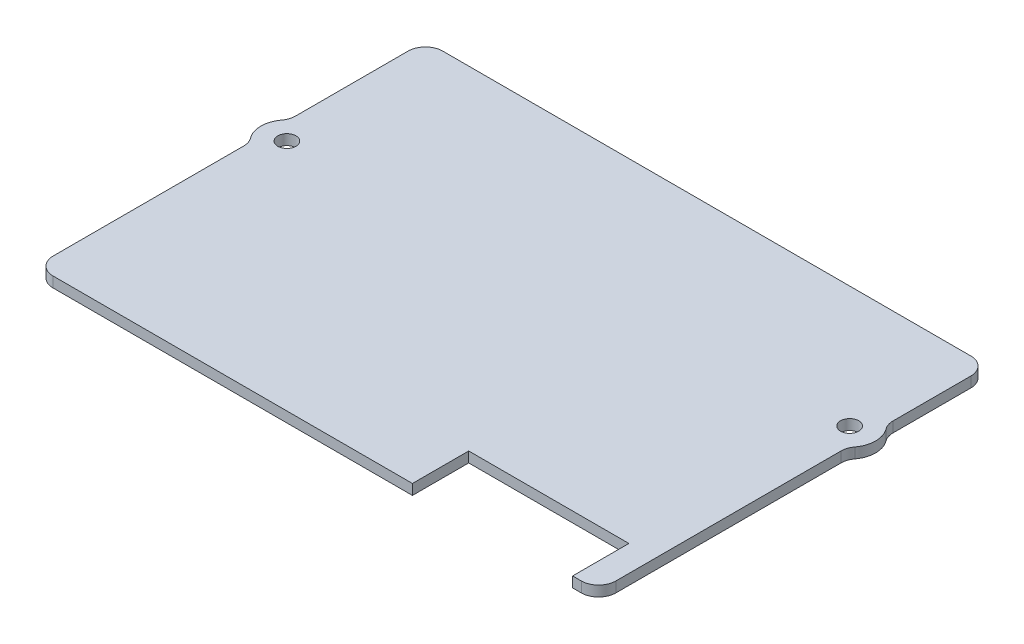
ISO-10303-21;
HEADER;
FILE_DESCRIPTION(('STEP AP214'),'2;1');
FILE_NAME('part.step','',(''),(''),'','','');
FILE_SCHEMA(('AUTOMOTIVE_DESIGN { 1 0 10303 214 1 1 1 1 }'));
ENDSEC;
DATA;
#1=APPLICATION_CONTEXT('core data for automotive mechanical design processes');
#2=APPLICATION_PROTOCOL_DEFINITION('international standard','automotive_design',2000,#1);
#3=PRODUCT_CONTEXT('',#1,'mechanical');
#4=PRODUCT('Part','Part','',(#3));
#5=PRODUCT_RELATED_PRODUCT_CATEGORY('part','',(#4));
#6=PRODUCT_DEFINITION_FORMATION('','',#4);
#7=PRODUCT_DEFINITION_CONTEXT('part definition',#1,'design');
#8=PRODUCT_DEFINITION('design','',#6,#7);
#9=PRODUCT_DEFINITION_SHAPE('','',#8);
#10=(LENGTH_UNIT() NAMED_UNIT(*) SI_UNIT(.MILLI.,.METRE.));
#11=(NAMED_UNIT(*) PLANE_ANGLE_UNIT() SI_UNIT($,.RADIAN.));
#12=(NAMED_UNIT(*) SI_UNIT($,.STERADIAN.) SOLID_ANGLE_UNIT());
#13=UNCERTAINTY_MEASURE_WITH_UNIT(LENGTH_MEASURE(1.E-05),#10,'distance_accuracy_value','');
#14=(GEOMETRIC_REPRESENTATION_CONTEXT(3) GLOBAL_UNCERTAINTY_ASSIGNED_CONTEXT((#13)) GLOBAL_UNIT_ASSIGNED_CONTEXT((#10,
#11,#12)) REPRESENTATION_CONTEXT('',''));
#15=CARTESIAN_POINT('',(0.,0.,0.));
#16=DIRECTION('',(0.,0.,1.));
#17=DIRECTION('',(1.,0.,0.));
#18=AXIS2_PLACEMENT_3D('',#15,#16,#17);
#19=CARTESIAN_POINT('',(0.,1.2,0.));
#20=DIRECTION('',(0.,0.,-1.));
#21=DIRECTION('',(-1.,0.,0.));
#22=AXIS2_PLACEMENT_3D('',#19,#20,#21);
#23=PLANE('',#22);
#24=DIRECTION('',(1.,0.,0.));
#25=VECTOR('',#24,1.);
#26=CARTESIAN_POINT('',(0.,0.,0.));
#27=LINE('',#26,#25);
#28=CARTESIAN_POINT('',(2.,0.,0.));
#29=VERTEX_POINT('',#28);
#30=CARTESIAN_POINT('',(43.5,0.,0.));
#31=VERTEX_POINT('',#30);
#32=EDGE_CURVE('E188',#29,#31,#27,.T.);
#33=ORIENTED_EDGE('',*,*,#32,.T.);
#34=DIRECTION('',(0.,1.,0.));
#35=VECTOR('',#34,1.);
#36=CARTESIAN_POINT('',(43.5,0.,0.));
#37=LINE('',#36,#35);
#38=CARTESIAN_POINT('',(43.5,1.2,0.));
#39=VERTEX_POINT('',#38);
#40=EDGE_CURVE('E171',#31,#39,#37,.T.);
#41=ORIENTED_EDGE('',*,*,#40,.T.);
#42=DIRECTION('',(1.,0.,0.));
#43=VECTOR('',#42,1.);
#44=CARTESIAN_POINT('',(0.,1.2,0.));
#45=LINE('',#44,#43);
#46=CARTESIAN_POINT('',(2.,1.2,0.));
#47=VERTEX_POINT('',#46);
#48=EDGE_CURVE('E313',#47,#39,#45,.T.);
#49=ORIENTED_EDGE('',*,*,#48,.F.);
#50=DIRECTION('',(0.,-1.,0.));
#51=VECTOR('',#50,1.);
#52=CARTESIAN_POINT('',(2.,1.2,0.));
#53=LINE('',#52,#51);
#54=EDGE_CURVE('E195',#47,#29,#53,.T.);
#55=ORIENTED_EDGE('',*,*,#54,.T.);
#56=EDGE_LOOP('',(#33,#41,#49,#55));
#57=FACE_BOUND('',#56,.T.);
#58=ADVANCED_FACE('F35',(#57),#23,.F.);
#59=CARTESIAN_POINT('',(65.,1.2,0.));
#60=DIRECTION('',(-1.,0.,0.));
#61=DIRECTION('',(0.,0.,1.));
#62=AXIS2_PLACEMENT_3D('',#59,#60,#61);
#63=PLANE('',#62);
#64=DIRECTION('',(0.,0.,-1.));
#65=VECTOR('',#64,1.);
#66=CARTESIAN_POINT('',(65.,0.,0.));
#67=LINE('',#66,#65);
#68=CARTESIAN_POINT('',(65.,0.,-2.));
#69=VERTEX_POINT('',#68);
#70=CARTESIAN_POINT('',(65.,0.,-28.));
#71=VERTEX_POINT('',#70);
#72=EDGE_CURVE('E199',#69,#71,#67,.T.);
#73=ORIENTED_EDGE('',*,*,#72,.T.);
#74=DIRECTION('',(0.,1.,0.));
#75=VECTOR('',#74,1.);
#76=CARTESIAN_POINT('',(65.,1.2,-28.));
#77=LINE('',#76,#75);
#78=CARTESIAN_POINT('',(65.,1.2,-28.));
#79=VERTEX_POINT('',#78);
#80=EDGE_CURVE('E250',#71,#79,#77,.T.);
#81=ORIENTED_EDGE('',*,*,#80,.T.);
#82=DIRECTION('',(0.,0.,-1.));
#83=VECTOR('',#82,1.);
#84=CARTESIAN_POINT('',(65.,1.2,0.));
#85=LINE('',#84,#83);
#86=CARTESIAN_POINT('',(65.,1.2,-2.));
#87=VERTEX_POINT('',#86);
#88=EDGE_CURVE('E316',#87,#79,#85,.T.);
#89=ORIENTED_EDGE('',*,*,#88,.F.);
#90=DIRECTION('',(0.,-1.,0.));
#91=VECTOR('',#90,1.);
#92=CARTESIAN_POINT('',(65.,1.2,-2.));
#93=LINE('',#92,#91);
#94=EDGE_CURVE('E244',#87,#69,#93,.T.);
#95=ORIENTED_EDGE('',*,*,#94,.T.);
#96=EDGE_LOOP('',(#73,#81,#89,#95));
#97=FACE_BOUND('',#96,.T.);
#98=ADVANCED_FACE('F395',(#97),#63,.F.);
#99=CARTESIAN_POINT('',(0.,1.2,0.));
#100=DIRECTION('',(1.,0.,0.));
#101=DIRECTION('',(0.,0.,-1.));
#102=AXIS2_PLACEMENT_3D('',#99,#100,#101);
#103=PLANE('',#102);
#104=DIRECTION('',(0.,0.,1.));
#105=VECTOR('',#104,1.);
#106=CARTESIAN_POINT('',(0.,0.,0.));
#107=LINE('',#106,#105);
#108=CARTESIAN_POINT('',(0.,0.,-43.));
#109=VERTEX_POINT('',#108);
#110=CARTESIAN_POINT('',(0.,0.,-30.));
#111=VERTEX_POINT('',#110);
#112=EDGE_CURVE('E201',#109,#111,#107,.T.);
#113=ORIENTED_EDGE('',*,*,#112,.T.);
#114=DIRECTION('',(0.,1.,0.));
#115=VECTOR('',#114,1.);
#116=CARTESIAN_POINT('',(0.,1.2,-30.));
#117=LINE('',#116,#115);
#118=CARTESIAN_POINT('',(0.,1.2,-30.));
#119=VERTEX_POINT('',#118);
#120=EDGE_CURVE('E267',#111,#119,#117,.T.);
#121=ORIENTED_EDGE('',*,*,#120,.T.);
#122=DIRECTION('',(0.,0.,1.));
#123=VECTOR('',#122,1.);
#124=CARTESIAN_POINT('',(0.,1.2,0.));
#125=LINE('',#124,#123);
#126=CARTESIAN_POINT('',(0.,1.2,-43.));
#127=VERTEX_POINT('',#126);
#128=EDGE_CURVE('E288',#127,#119,#125,.T.);
#129=ORIENTED_EDGE('',*,*,#128,.F.);
#130=DIRECTION('',(0.,-1.,0.));
#131=VECTOR('',#130,1.);
#132=CARTESIAN_POINT('',(0.,1.2,-43.));
#133=LINE('',#132,#131);
#134=EDGE_CURVE('E225',#127,#109,#133,.T.);
#135=ORIENTED_EDGE('',*,*,#134,.T.);
#136=EDGE_LOOP('',(#113,#121,#129,#135));
#137=FACE_BOUND('',#136,.T.);
#138=ADVANCED_FACE('F301',(#137),#103,.F.);
#139=CARTESIAN_POINT('',(0.,1.2,-24.));
#140=VERTEX_POINT('',#139);
#141=CARTESIAN_POINT('',(0.,1.2,-2.));
#142=VERTEX_POINT('',#141);
#143=EDGE_CURVE('E209',#140,#142,#125,.T.);
#144=ORIENTED_EDGE('',*,*,#143,.F.);
#145=DIRECTION('',(0.,1.,0.));
#146=VECTOR('',#145,1.);
#147=CARTESIAN_POINT('',(0.,1.2,-24.));
#148=LINE('',#147,#146);
#149=CARTESIAN_POINT('',(0.,0.,-24.));
#150=VERTEX_POINT('',#149);
#151=EDGE_CURVE('E260',#140,#150,#148,.F.);
#152=ORIENTED_EDGE('',*,*,#151,.T.);
#153=CARTESIAN_POINT('',(0.,0.,-2.));
#154=VERTEX_POINT('',#153);
#155=EDGE_CURVE('E303',#150,#154,#107,.T.);
#156=ORIENTED_EDGE('',*,*,#155,.T.);
#157=DIRECTION('',(0.,-1.,0.));
#158=VECTOR('',#157,1.);
#159=CARTESIAN_POINT('',(0.,1.2,-2.));
#160=LINE('',#159,#158);
#161=EDGE_CURVE('E228',#154,#142,#160,.F.);
#162=ORIENTED_EDGE('',*,*,#161,.T.);
#163=EDGE_LOOP('',(#144,#152,#156,#162));
#164=FACE_BOUND('',#163,.T.);
#165=ADVANCED_FACE('F404',(#164),#103,.F.);
#166=CARTESIAN_POINT('',(62.,1.2,0.));
#167=VERTEX_POINT('',#166);
#168=CARTESIAN_POINT('',(63.,1.2,0.));
#169=VERTEX_POINT('',#168);
#170=EDGE_CURVE('E312',#167,#169,#45,.T.);
#171=ORIENTED_EDGE('',*,*,#170,.F.);
#172=DIRECTION('',(0.,1.,0.));
#173=VECTOR('',#172,1.);
#174=CARTESIAN_POINT('',(62.,0.,0.));
#175=LINE('',#174,#173);
#176=CARTESIAN_POINT('',(62.,0.,0.));
#177=VERTEX_POINT('',#176);
#178=EDGE_CURVE('E181',#177,#167,#175,.T.);
#179=ORIENTED_EDGE('',*,*,#178,.F.);
#180=CARTESIAN_POINT('',(63.,0.,0.));
#181=VERTEX_POINT('',#180);
#182=EDGE_CURVE('E197',#177,#181,#27,.T.);
#183=ORIENTED_EDGE('',*,*,#182,.T.);
#184=DIRECTION('',(0.,-1.,0.));
#185=VECTOR('',#184,1.);
#186=CARTESIAN_POINT('',(63.,1.2,0.));
#187=LINE('',#186,#185);
#188=EDGE_CURVE('E210',#181,#169,#187,.F.);
#189=ORIENTED_EDGE('',*,*,#188,.T.);
#190=EDGE_LOOP('',(#171,#179,#183,#189));
#191=FACE_BOUND('',#190,.T.);
#192=ADVANCED_FACE('F380',(#191),#23,.F.);
#193=CARTESIAN_POINT('',(65.,1.2,-34.));
#194=VERTEX_POINT('',#193);
#195=CARTESIAN_POINT('',(65.,1.2,-43.));
#196=VERTEX_POINT('',#195);
#197=EDGE_CURVE('E315',#194,#196,#85,.T.);
#198=ORIENTED_EDGE('',*,*,#197,.F.);
#199=DIRECTION('',(0.,1.,0.));
#200=VECTOR('',#199,1.);
#201=CARTESIAN_POINT('',(65.,1.2,-34.));
#202=LINE('',#201,#200);
#203=CARTESIAN_POINT('',(65.,0.,-34.));
#204=VERTEX_POINT('',#203);
#205=EDGE_CURVE('E257',#194,#204,#202,.F.);
#206=ORIENTED_EDGE('',*,*,#205,.T.);
#207=CARTESIAN_POINT('',(65.,0.,-43.));
#208=VERTEX_POINT('',#207);
#209=EDGE_CURVE('E196',#204,#208,#67,.T.);
#210=ORIENTED_EDGE('',*,*,#209,.T.);
#211=DIRECTION('',(0.,-1.,0.));
#212=VECTOR('',#211,1.);
#213=CARTESIAN_POINT('',(65.,1.2,-43.));
#214=LINE('',#213,#212);
#215=EDGE_CURVE('E247',#208,#196,#214,.F.);
#216=ORIENTED_EDGE('',*,*,#215,.T.);
#217=EDGE_LOOP('',(#198,#206,#210,#216));
#218=FACE_BOUND('',#217,.T.);
#219=ADVANCED_FACE('F337',(#218),#63,.F.);
#220=CARTESIAN_POINT('',(0.,1.2,-45.));
#221=DIRECTION('',(0.,0.,1.));
#222=DIRECTION('',(1.,0.,0.));
#223=AXIS2_PLACEMENT_3D('',#220,#221,#222);
#224=PLANE('',#223);
#225=DIRECTION('',(-1.,0.,0.));
#226=VECTOR('',#225,1.);
#227=CARTESIAN_POINT('',(0.,0.,-45.));
#228=LINE('',#227,#226);
#229=CARTESIAN_POINT('',(63.,0.,-45.));
#230=VERTEX_POINT('',#229);
#231=CARTESIAN_POINT('',(2.,0.,-45.));
#232=VERTEX_POINT('',#231);
#233=EDGE_CURVE('E206',#230,#232,#228,.T.);
#234=ORIENTED_EDGE('',*,*,#233,.T.);
#235=DIRECTION('',(0.,-1.,0.));
#236=VECTOR('',#235,1.);
#237=CARTESIAN_POINT('',(2.,1.2,-45.));
#238=LINE('',#237,#236);
#239=CARTESIAN_POINT('',(2.,1.2,-45.));
#240=VERTEX_POINT('',#239);
#241=EDGE_CURVE('E242',#232,#240,#238,.F.);
#242=ORIENTED_EDGE('',*,*,#241,.T.);
#243=DIRECTION('',(-1.,0.,0.));
#244=VECTOR('',#243,1.);
#245=CARTESIAN_POINT('',(0.,1.2,-45.));
#246=LINE('',#245,#244);
#247=CARTESIAN_POINT('',(63.,1.2,-45.));
#248=VERTEX_POINT('',#247);
#249=EDGE_CURVE('E213',#248,#240,#246,.T.);
#250=ORIENTED_EDGE('',*,*,#249,.F.);
#251=DIRECTION('',(0.,-1.,0.));
#252=VECTOR('',#251,1.);
#253=CARTESIAN_POINT('',(63.,1.2,-45.));
#254=LINE('',#253,#252);
#255=EDGE_CURVE('E239',#248,#230,#254,.T.);
#256=ORIENTED_EDGE('',*,*,#255,.T.);
#257=EDGE_LOOP('',(#234,#242,#250,#256));
#258=FACE_BOUND('',#257,.T.);
#259=ADVANCED_FACE('F328',(#258),#224,.F.);
#260=CARTESIAN_POINT('',(0.,1.2,0.));
#261=DIRECTION('',(0.,-1.,0.));
#262=DIRECTION('',(0.,0.,-1.));
#263=AXIS2_PLACEMENT_3D('',#260,#261,#262);
#264=PLANE('',#263);
#265=CARTESIAN_POINT('',(2.,1.2,-27.));
#266=DIRECTION('',(0.,1.,0.));
#267=DIRECTION('',(0.,0.,1.));
#268=AXIS2_PLACEMENT_3D('',#265,#266,#267);
#269=CIRCLE('',#268,1.05);
#270=CARTESIAN_POINT('',(2.,1.2,-25.95));
#271=VERTEX_POINT('',#270);
#272=EDGE_CURVE('E357',#271,#271,#269,.T.);
#273=ORIENTED_EDGE('',*,*,#272,.F.);
#274=EDGE_LOOP('',(#273));
#275=FACE_BOUND('',#274,.T.);
#276=CARTESIAN_POINT('',(63.,1.2,-31.));
#277=DIRECTION('',(0.,1.,0.));
#278=DIRECTION('',(0.,0.,1.));
#279=AXIS2_PLACEMENT_3D('',#276,#277,#278);
#280=CIRCLE('',#279,1.05000000000001);
#281=CARTESIAN_POINT('',(63.,1.2,-29.95));
#282=VERTEX_POINT('',#281);
#283=EDGE_CURVE('E353',#282,#282,#280,.T.);
#284=ORIENTED_EDGE('',*,*,#283,.F.);
#285=EDGE_LOOP('',(#284));
#286=FACE_BOUND('',#285,.T.);
#287=ORIENTED_EDGE('',*,*,#48,.T.);
#288=DIRECTION('',(0.,0.,1.));
#289=VECTOR('',#288,1.);
#290=CARTESIAN_POINT('',(43.5,1.2,0.));
#291=LINE('',#290,#289);
#292=CARTESIAN_POINT('',(43.5,1.2,-6.5));
#293=VERTEX_POINT('',#292);
#294=EDGE_CURVE('E176',#293,#39,#291,.T.);
#295=ORIENTED_EDGE('',*,*,#294,.F.);
#296=DIRECTION('',(-1.,0.,0.));
#297=VECTOR('',#296,1.);
#298=CARTESIAN_POINT('',(43.5,1.2,-6.5));
#299=LINE('',#298,#297);
#300=CARTESIAN_POINT('',(62.,1.2,-6.5));
#301=VERTEX_POINT('',#300);
#302=EDGE_CURVE('E191',#301,#293,#299,.T.);
#303=ORIENTED_EDGE('',*,*,#302,.F.);
#304=DIRECTION('',(0.,0.,-1.));
#305=VECTOR('',#304,1.);
#306=CARTESIAN_POINT('',(62.,1.2,0.));
#307=LINE('',#306,#305);
#308=EDGE_CURVE('E368',#167,#301,#307,.T.);
#309=ORIENTED_EDGE('',*,*,#308,.F.);
#310=ORIENTED_EDGE('',*,*,#170,.T.);
#311=CARTESIAN_POINT('',(63.,1.2,-2.));
#312=DIRECTION('',(0.,-1.,0.));
#313=DIRECTION('',(0.,0.,-1.));
#314=AXIS2_PLACEMENT_3D('',#311,#312,#313);
#315=CIRCLE('',#314,2.);
#316=EDGE_CURVE('E231',#169,#87,#315,.F.);
#317=ORIENTED_EDGE('',*,*,#316,.T.);
#318=ORIENTED_EDGE('',*,*,#88,.T.);
#319=CARTESIAN_POINT('',(67.,1.2,-28.));
#320=DIRECTION('',(0.,-1.,0.));
#321=DIRECTION('',(0.,0.,-1.));
#322=AXIS2_PLACEMENT_3D('',#319,#320,#321);
#323=CIRCLE('',#322,2.);
#324=CARTESIAN_POINT('',(65.4,1.2,-29.2));
#325=VERTEX_POINT('',#324);
#326=EDGE_CURVE('E269',#79,#325,#323,.T.);
#327=ORIENTED_EDGE('',*,*,#326,.T.);
#328=CARTESIAN_POINT('',(63.,1.2,-31.));
#329=DIRECTION('',(0.,1.,0.));
#330=DIRECTION('',(0.,0.,1.));
#331=AXIS2_PLACEMENT_3D('',#328,#329,#330);
#332=CIRCLE('',#331,3.00000000000001);
#333=CARTESIAN_POINT('',(65.4,1.2,-32.8));
#334=VERTEX_POINT('',#333);
#335=EDGE_CURVE('E295',#325,#334,#332,.T.);
#336=ORIENTED_EDGE('',*,*,#335,.T.);
#337=CARTESIAN_POINT('',(67.,1.2,-34.));
#338=DIRECTION('',(0.,-1.,0.));
#339=DIRECTION('',(0.,0.,-1.));
#340=AXIS2_PLACEMENT_3D('',#337,#338,#339);
#341=CIRCLE('',#340,2.);
#342=EDGE_CURVE('E275',#334,#194,#341,.T.);
#343=ORIENTED_EDGE('',*,*,#342,.T.);
#344=ORIENTED_EDGE('',*,*,#197,.T.);
#345=CARTESIAN_POINT('',(63.,1.2,-43.));
#346=DIRECTION('',(0.,-1.,0.));
#347=DIRECTION('',(0.,0.,-1.));
#348=AXIS2_PLACEMENT_3D('',#345,#346,#347);
#349=CIRCLE('',#348,2.);
#350=EDGE_CURVE('E233',#196,#248,#349,.F.);
#351=ORIENTED_EDGE('',*,*,#350,.T.);
#352=ORIENTED_EDGE('',*,*,#249,.T.);
#353=CARTESIAN_POINT('',(2.,1.2,-43.));
#354=DIRECTION('',(0.,-1.,0.));
#355=DIRECTION('',(0.,0.,-1.));
#356=AXIS2_PLACEMENT_3D('',#353,#354,#355);
#357=CIRCLE('',#356,2.);
#358=EDGE_CURVE('E235',#240,#127,#357,.F.);
#359=ORIENTED_EDGE('',*,*,#358,.T.);
#360=ORIENTED_EDGE('',*,*,#128,.T.);
#361=CARTESIAN_POINT('',(-2.,1.2,-30.));
#362=DIRECTION('',(0.,-1.,0.));
#363=DIRECTION('',(0.,0.,-1.));
#364=AXIS2_PLACEMENT_3D('',#361,#362,#363);
#365=CIRCLE('',#364,2.);
#366=CARTESIAN_POINT('',(-0.4,1.2,-28.8));
#367=VERTEX_POINT('',#366);
#368=EDGE_CURVE('E43',#119,#367,#365,.T.);
#369=ORIENTED_EDGE('',*,*,#368,.T.);
#370=CARTESIAN_POINT('',(2.,1.2,-27.));
#371=DIRECTION('',(0.,1.,0.));
#372=DIRECTION('',(0.,0.,1.));
#373=AXIS2_PLACEMENT_3D('',#370,#371,#372);
#374=CIRCLE('',#373,3.);
#375=CARTESIAN_POINT('',(-0.4,1.2,-25.2));
#376=VERTEX_POINT('',#375);
#377=EDGE_CURVE('E285',#367,#376,#374,.T.);
#378=ORIENTED_EDGE('',*,*,#377,.T.);
#379=CARTESIAN_POINT('',(-2.,1.2,-24.));
#380=DIRECTION('',(0.,-1.,0.));
#381=DIRECTION('',(0.,0.,-1.));
#382=AXIS2_PLACEMENT_3D('',#379,#380,#381);
#383=CIRCLE('',#382,2.);
#384=EDGE_CURVE('E279',#376,#140,#383,.T.);
#385=ORIENTED_EDGE('',*,*,#384,.T.);
#386=ORIENTED_EDGE('',*,*,#143,.T.);
#387=CARTESIAN_POINT('',(2.,1.2,-2.));
#388=DIRECTION('',(0.,-1.,0.));
#389=DIRECTION('',(0.,0.,-1.));
#390=AXIS2_PLACEMENT_3D('',#387,#388,#389);
#391=CIRCLE('',#390,2.);
#392=EDGE_CURVE('E237',#142,#47,#391,.F.);
#393=ORIENTED_EDGE('',*,*,#392,.T.);
#394=EDGE_LOOP('',(#287,#295,#303,#309,#310,#317,#318,#327,#336,#343,#344,#351,#352,#359,#360,
#369,#378,#385,#386,#393));
#395=FACE_BOUND('',#394,.T.);
#396=ADVANCED_FACE('F284',(#275,#286,#395),#264,.F.);
#397=CARTESIAN_POINT('',(0.,0.,0.));
#398=DIRECTION('',(0.,-1.,0.));
#399=DIRECTION('',(0.,0.,-1.));
#400=AXIS2_PLACEMENT_3D('',#397,#398,#399);
#401=PLANE('',#400);
#402=DIRECTION('',(0.,0.,1.));
#403=VECTOR('',#402,1.);
#404=CARTESIAN_POINT('',(43.5,0.,0.));
#405=LINE('',#404,#403);
#406=CARTESIAN_POINT('',(43.5,0.,-6.5));
#407=VERTEX_POINT('',#406);
#408=EDGE_CURVE('E174',#407,#31,#405,.T.);
#409=ORIENTED_EDGE('',*,*,#408,.T.);
#410=ORIENTED_EDGE('',*,*,#32,.F.);
#411=CARTESIAN_POINT('',(2.,0.,-2.));
#412=DIRECTION('',(0.,-1.,0.));
#413=DIRECTION('',(0.,0.,-1.));
#414=AXIS2_PLACEMENT_3D('',#411,#412,#413);
#415=CIRCLE('',#414,2.);
#416=EDGE_CURVE('E223',#29,#154,#415,.T.);
#417=ORIENTED_EDGE('',*,*,#416,.T.);
#418=ORIENTED_EDGE('',*,*,#155,.F.);
#419=CARTESIAN_POINT('',(-2.,0.,-24.));
#420=DIRECTION('',(0.,-1.,0.));
#421=DIRECTION('',(0.,0.,-1.));
#422=AXIS2_PLACEMENT_3D('',#419,#420,#421);
#423=CIRCLE('',#422,2.);
#424=CARTESIAN_POINT('',(-0.4,0.,-25.2));
#425=VERTEX_POINT('',#424);
#426=EDGE_CURVE('E277',#150,#425,#423,.F.);
#427=ORIENTED_EDGE('',*,*,#426,.T.);
#428=CARTESIAN_POINT('',(2.,0.,-27.));
#429=DIRECTION('',(0.,1.,0.));
#430=DIRECTION('',(0.,0.,1.));
#431=AXIS2_PLACEMENT_3D('',#428,#429,#430);
#432=CIRCLE('',#431,3.);
#433=CARTESIAN_POINT('',(-0.4,0.,-28.8));
#434=VERTEX_POINT('',#433);
#435=EDGE_CURVE('E294',#434,#425,#432,.T.);
#436=ORIENTED_EDGE('',*,*,#435,.F.);
#437=CARTESIAN_POINT('',(-2.,0.,-30.));
#438=DIRECTION('',(0.,-1.,0.));
#439=DIRECTION('',(0.,0.,-1.));
#440=AXIS2_PLACEMENT_3D('',#437,#438,#439);
#441=CIRCLE('',#440,2.);
#442=EDGE_CURVE('E11',#434,#111,#441,.F.);
#443=ORIENTED_EDGE('',*,*,#442,.T.);
#444=ORIENTED_EDGE('',*,*,#112,.F.);
#445=CARTESIAN_POINT('',(2.,0.,-43.));
#446=DIRECTION('',(0.,-1.,0.));
#447=DIRECTION('',(0.,0.,-1.));
#448=AXIS2_PLACEMENT_3D('',#445,#446,#447);
#449=CIRCLE('',#448,2.);
#450=EDGE_CURVE('E221',#109,#232,#449,.T.);
#451=ORIENTED_EDGE('',*,*,#450,.T.);
#452=ORIENTED_EDGE('',*,*,#233,.F.);
#453=CARTESIAN_POINT('',(63.,0.,-43.));
#454=DIRECTION('',(0.,-1.,0.));
#455=DIRECTION('',(0.,0.,-1.));
#456=AXIS2_PLACEMENT_3D('',#453,#454,#455);
#457=CIRCLE('',#456,2.);
#458=EDGE_CURVE('E218',#230,#208,#457,.T.);
#459=ORIENTED_EDGE('',*,*,#458,.T.);
#460=ORIENTED_EDGE('',*,*,#209,.F.);
#461=CARTESIAN_POINT('',(67.,0.,-34.));
#462=DIRECTION('',(0.,-1.,0.));
#463=DIRECTION('',(0.,0.,-1.));
#464=AXIS2_PLACEMENT_3D('',#461,#462,#463);
#465=CIRCLE('',#464,2.);
#466=CARTESIAN_POINT('',(65.4,0.,-32.8));
#467=VERTEX_POINT('',#466);
#468=EDGE_CURVE('E273',#204,#467,#465,.F.);
#469=ORIENTED_EDGE('',*,*,#468,.T.);
#470=CARTESIAN_POINT('',(63.,0.,-31.));
#471=DIRECTION('',(0.,1.,0.));
#472=DIRECTION('',(0.,0.,1.));
#473=AXIS2_PLACEMENT_3D('',#470,#471,#472);
#474=CIRCLE('',#473,3.00000000000001);
#475=CARTESIAN_POINT('',(65.4,0.,-29.2));
#476=VERTEX_POINT('',#475);
#477=EDGE_CURVE('E308',#476,#467,#474,.T.);
#478=ORIENTED_EDGE('',*,*,#477,.F.);
#479=CARTESIAN_POINT('',(67.,0.,-28.));
#480=DIRECTION('',(0.,-1.,0.));
#481=DIRECTION('',(0.,0.,-1.));
#482=AXIS2_PLACEMENT_3D('',#479,#480,#481);
#483=CIRCLE('',#482,2.);
#484=EDGE_CURVE('E271',#476,#71,#483,.F.);
#485=ORIENTED_EDGE('',*,*,#484,.T.);
#486=ORIENTED_EDGE('',*,*,#72,.F.);
#487=CARTESIAN_POINT('',(63.,0.,-2.));
#488=DIRECTION('',(0.,-1.,0.));
#489=DIRECTION('',(0.,0.,-1.));
#490=AXIS2_PLACEMENT_3D('',#487,#488,#489);
#491=CIRCLE('',#490,2.);
#492=EDGE_CURVE('E215',#69,#181,#491,.T.);
#493=ORIENTED_EDGE('',*,*,#492,.T.);
#494=ORIENTED_EDGE('',*,*,#182,.F.);
#495=DIRECTION('',(0.,0.,-1.));
#496=VECTOR('',#495,1.);
#497=CARTESIAN_POINT('',(62.,0.,0.));
#498=LINE('',#497,#496);
#499=CARTESIAN_POINT('',(62.,0.,-6.5));
#500=VERTEX_POINT('',#499);
#501=EDGE_CURVE('E190',#177,#500,#498,.T.);
#502=ORIENTED_EDGE('',*,*,#501,.T.);
#503=DIRECTION('',(-1.,0.,0.));
#504=VECTOR('',#503,1.);
#505=CARTESIAN_POINT('',(43.5,0.,-6.5));
#506=LINE('',#505,#504);
#507=EDGE_CURVE('E50',#500,#407,#506,.T.);
#508=ORIENTED_EDGE('',*,*,#507,.T.);
#509=EDGE_LOOP('',(#409,#410,#417,#418,#427,#436,#443,#444,#451,#452,#459,#460,#469,#478,#485,
#486,#493,#494,#502,#508));
#510=FACE_BOUND('',#509,.T.);
#511=CARTESIAN_POINT('',(2.,0.,-27.));
#512=DIRECTION('',(0.,1.,0.));
#513=DIRECTION('',(0.,0.,1.));
#514=AXIS2_PLACEMENT_3D('',#511,#512,#513);
#515=CIRCLE('',#514,1.05);
#516=CARTESIAN_POINT('',(2.,0.,-25.95));
#517=VERTEX_POINT('',#516);
#518=EDGE_CURVE('E348',#517,#517,#515,.T.);
#519=ORIENTED_EDGE('',*,*,#518,.T.);
#520=EDGE_LOOP('',(#519));
#521=FACE_BOUND('',#520,.T.);
#522=CARTESIAN_POINT('',(63.,0.,-31.));
#523=DIRECTION('',(0.,1.,0.));
#524=DIRECTION('',(0.,0.,1.));
#525=AXIS2_PLACEMENT_3D('',#522,#523,#524);
#526=CIRCLE('',#525,1.05000000000001);
#527=CARTESIAN_POINT('',(63.,0.,-29.95));
#528=VERTEX_POINT('',#527);
#529=EDGE_CURVE('E350',#528,#528,#526,.T.);
#530=ORIENTED_EDGE('',*,*,#529,.T.);
#531=EDGE_LOOP('',(#530));
#532=FACE_BOUND('',#531,.T.);
#533=ADVANCED_FACE('F185',(#510,#521,#532),#401,.T.);
#534=CARTESIAN_POINT('',(2.,1.2,-2.));
#535=DIRECTION('',(0.,-1.,0.));
#536=DIRECTION('',(0.,0.,-1.));
#537=AXIS2_PLACEMENT_3D('',#534,#535,#536);
#538=CYLINDRICAL_SURFACE('',#537,2.);
#539=ORIENTED_EDGE('',*,*,#392,.F.);
#540=ORIENTED_EDGE('',*,*,#161,.F.);
#541=ORIENTED_EDGE('',*,*,#416,.F.);
#542=ORIENTED_EDGE('',*,*,#54,.F.);
#543=EDGE_LOOP('',(#539,#540,#541,#542));
#544=FACE_BOUND('',#543,.T.);
#545=ADVANCED_FACE('F414',(#544),#538,.T.);
#546=CARTESIAN_POINT('',(2.,1.2,-43.));
#547=DIRECTION('',(0.,-1.,0.));
#548=DIRECTION('',(0.,0.,-1.));
#549=AXIS2_PLACEMENT_3D('',#546,#547,#548);
#550=CYLINDRICAL_SURFACE('',#549,2.);
#551=ORIENTED_EDGE('',*,*,#358,.F.);
#552=ORIENTED_EDGE('',*,*,#241,.F.);
#553=ORIENTED_EDGE('',*,*,#450,.F.);
#554=ORIENTED_EDGE('',*,*,#134,.F.);
#555=EDGE_LOOP('',(#551,#552,#553,#554));
#556=FACE_BOUND('',#555,.T.);
#557=ADVANCED_FACE('F326',(#556),#550,.T.);
#558=CARTESIAN_POINT('',(63.,1.2,-43.));
#559=DIRECTION('',(0.,-1.,0.));
#560=DIRECTION('',(0.,0.,-1.));
#561=AXIS2_PLACEMENT_3D('',#558,#559,#560);
#562=CYLINDRICAL_SURFACE('',#561,2.);
#563=ORIENTED_EDGE('',*,*,#350,.F.);
#564=ORIENTED_EDGE('',*,*,#215,.F.);
#565=ORIENTED_EDGE('',*,*,#458,.F.);
#566=ORIENTED_EDGE('',*,*,#255,.F.);
#567=EDGE_LOOP('',(#563,#564,#565,#566));
#568=FACE_BOUND('',#567,.T.);
#569=ADVANCED_FACE('F330',(#568),#562,.T.);
#570=CARTESIAN_POINT('',(63.,1.2,-2.));
#571=DIRECTION('',(0.,-1.,0.));
#572=DIRECTION('',(0.,0.,-1.));
#573=AXIS2_PLACEMENT_3D('',#570,#571,#572);
#574=CYLINDRICAL_SURFACE('',#573,2.);
#575=ORIENTED_EDGE('',*,*,#316,.F.);
#576=ORIENTED_EDGE('',*,*,#188,.F.);
#577=ORIENTED_EDGE('',*,*,#492,.F.);
#578=ORIENTED_EDGE('',*,*,#94,.F.);
#579=EDGE_LOOP('',(#575,#576,#577,#578));
#580=FACE_BOUND('',#579,.T.);
#581=ADVANCED_FACE('F422',(#580),#574,.T.);
#582=CARTESIAN_POINT('',(2.,0.,-27.));
#583=DIRECTION('',(0.,1.,0.));
#584=DIRECTION('',(0.,0.,1.));
#585=AXIS2_PLACEMENT_3D('',#582,#583,#584);
#586=CYLINDRICAL_SURFACE('',#585,3.);
#587=ORIENTED_EDGE('',*,*,#435,.T.);
#588=DIRECTION('',(0.,1.,0.));
#589=VECTOR('',#588,1.);
#590=CARTESIAN_POINT('',(-0.4,0.,-25.2));
#591=LINE('',#590,#589);
#592=EDGE_CURVE('E265',#425,#376,#591,.T.);
#593=ORIENTED_EDGE('',*,*,#592,.T.);
#594=ORIENTED_EDGE('',*,*,#377,.F.);
#595=DIRECTION('',(0.,1.,0.));
#596=VECTOR('',#595,1.);
#597=CARTESIAN_POINT('',(-0.4,0.,-28.8));
#598=LINE('',#597,#596);
#599=EDGE_CURVE('E263',#367,#434,#598,.F.);
#600=ORIENTED_EDGE('',*,*,#599,.T.);
#601=EDGE_LOOP('',(#587,#593,#594,#600));
#602=FACE_BOUND('',#601,.T.);
#603=ADVANCED_FACE('F291',(#602),#586,.T.);
#604=CARTESIAN_POINT('',(63.,0.,-31.));
#605=DIRECTION('',(0.,1.,0.));
#606=DIRECTION('',(0.,0.,1.));
#607=AXIS2_PLACEMENT_3D('',#604,#605,#606);
#608=CYLINDRICAL_SURFACE('',#607,3.00000000000001);
#609=ORIENTED_EDGE('',*,*,#335,.F.);
#610=DIRECTION('',(0.,1.,0.));
#611=VECTOR('',#610,1.);
#612=CARTESIAN_POINT('',(65.4,0.,-29.2));
#613=LINE('',#612,#611);
#614=EDGE_CURVE('E255',#325,#476,#613,.F.);
#615=ORIENTED_EDGE('',*,*,#614,.T.);
#616=ORIENTED_EDGE('',*,*,#477,.T.);
#617=DIRECTION('',(0.,1.,0.));
#618=VECTOR('',#617,1.);
#619=CARTESIAN_POINT('',(65.4,0.,-32.8));
#620=LINE('',#619,#618);
#621=EDGE_CURVE('E253',#467,#334,#620,.T.);
#622=ORIENTED_EDGE('',*,*,#621,.T.);
#623=EDGE_LOOP('',(#609,#615,#616,#622));
#624=FACE_BOUND('',#623,.T.);
#625=ADVANCED_FACE('F346',(#624),#608,.T.);
#626=CARTESIAN_POINT('',(63.,0.,-31.));
#627=DIRECTION('',(0.,1.,0.));
#628=DIRECTION('',(0.,0.,1.));
#629=AXIS2_PLACEMENT_3D('',#626,#627,#628);
#630=CYLINDRICAL_SURFACE('',#629,1.05000000000001);
#631=ORIENTED_EDGE('',*,*,#529,.F.);
#632=EDGE_LOOP('',(#631));
#633=FACE_BOUND('',#632,.T.);
#634=ORIENTED_EDGE('',*,*,#283,.T.);
#635=EDGE_LOOP('',(#634));
#636=FACE_BOUND('',#635,.T.);
#637=ADVANCED_FACE('F515',(#633,#636),#630,.F.);
#638=CARTESIAN_POINT('',(2.,0.,-27.));
#639=DIRECTION('',(0.,1.,0.));
#640=DIRECTION('',(0.,0.,1.));
#641=AXIS2_PLACEMENT_3D('',#638,#639,#640);
#642=CYLINDRICAL_SURFACE('',#641,1.05);
#643=ORIENTED_EDGE('',*,*,#518,.F.);
#644=EDGE_LOOP('',(#643));
#645=FACE_BOUND('',#644,.T.);
#646=ORIENTED_EDGE('',*,*,#272,.T.);
#647=EDGE_LOOP('',(#646));
#648=FACE_BOUND('',#647,.T.);
#649=ADVANCED_FACE('F429',(#645,#648),#642,.F.);
#650=CARTESIAN_POINT('',(67.,0.,-28.));
#651=DIRECTION('',(0.,1.,0.));
#652=DIRECTION('',(0.,0.,1.));
#653=AXIS2_PLACEMENT_3D('',#650,#651,#652);
#654=CYLINDRICAL_SURFACE('',#653,2.);
#655=ORIENTED_EDGE('',*,*,#484,.F.);
#656=ORIENTED_EDGE('',*,*,#614,.F.);
#657=ORIENTED_EDGE('',*,*,#326,.F.);
#658=ORIENTED_EDGE('',*,*,#80,.F.);
#659=EDGE_LOOP('',(#655,#656,#657,#658));
#660=FACE_BOUND('',#659,.T.);
#661=ADVANCED_FACE('F426',(#660),#654,.F.);
#662=CARTESIAN_POINT('',(67.,0.,-34.));
#663=DIRECTION('',(0.,1.,0.));
#664=DIRECTION('',(0.,0.,1.));
#665=AXIS2_PLACEMENT_3D('',#662,#663,#664);
#666=CYLINDRICAL_SURFACE('',#665,2.);
#667=ORIENTED_EDGE('',*,*,#342,.F.);
#668=ORIENTED_EDGE('',*,*,#621,.F.);
#669=ORIENTED_EDGE('',*,*,#468,.F.);
#670=ORIENTED_EDGE('',*,*,#205,.F.);
#671=EDGE_LOOP('',(#667,#668,#669,#670));
#672=FACE_BOUND('',#671,.T.);
#673=ADVANCED_FACE('F341',(#672),#666,.F.);
#674=CARTESIAN_POINT('',(-2.,0.,-24.));
#675=DIRECTION('',(0.,1.,0.));
#676=DIRECTION('',(0.,0.,1.));
#677=AXIS2_PLACEMENT_3D('',#674,#675,#676);
#678=CYLINDRICAL_SURFACE('',#677,2.);
#679=ORIENTED_EDGE('',*,*,#384,.F.);
#680=ORIENTED_EDGE('',*,*,#592,.F.);
#681=ORIENTED_EDGE('',*,*,#426,.F.);
#682=ORIENTED_EDGE('',*,*,#151,.F.);
#683=EDGE_LOOP('',(#679,#680,#681,#682));
#684=FACE_BOUND('',#683,.T.);
#685=ADVANCED_FACE('F432',(#684),#678,.F.);
#686=CARTESIAN_POINT('',(-2.,0.,-30.));
#687=DIRECTION('',(0.,1.,0.));
#688=DIRECTION('',(0.,0.,1.));
#689=AXIS2_PLACEMENT_3D('',#686,#687,#688);
#690=CYLINDRICAL_SURFACE('',#689,2.);
#691=ORIENTED_EDGE('',*,*,#442,.F.);
#692=ORIENTED_EDGE('',*,*,#599,.F.);
#693=ORIENTED_EDGE('',*,*,#368,.F.);
#694=ORIENTED_EDGE('',*,*,#120,.F.);
#695=EDGE_LOOP('',(#691,#692,#693,#694));
#696=FACE_BOUND('',#695,.T.);
#697=ADVANCED_FACE('F37',(#696),#690,.F.);
#698=CARTESIAN_POINT('',(43.5,0.,0.));
#699=DIRECTION('',(-1.,0.,0.));
#700=DIRECTION('',(0.,0.,1.));
#701=AXIS2_PLACEMENT_3D('',#698,#699,#700);
#702=PLANE('',#701);
#703=ORIENTED_EDGE('',*,*,#294,.T.);
#704=ORIENTED_EDGE('',*,*,#40,.F.);
#705=ORIENTED_EDGE('',*,*,#408,.F.);
#706=DIRECTION('',(0.,1.,0.));
#707=VECTOR('',#706,1.);
#708=CARTESIAN_POINT('',(43.5,0.,-6.5));
#709=LINE('',#708,#707);
#710=EDGE_CURVE('E354',#407,#293,#709,.T.);
#711=ORIENTED_EDGE('',*,*,#710,.T.);
#712=EDGE_LOOP('',(#703,#704,#705,#711));
#713=FACE_BOUND('',#712,.T.);
#714=ADVANCED_FACE('F173',(#713),#702,.F.);
#715=CARTESIAN_POINT('',(43.5,0.,-6.5));
#716=DIRECTION('',(0.,0.,-1.));
#717=DIRECTION('',(-1.,0.,0.));
#718=AXIS2_PLACEMENT_3D('',#715,#716,#717);
#719=PLANE('',#718);
#720=ORIENTED_EDGE('',*,*,#302,.T.);
#721=ORIENTED_EDGE('',*,*,#710,.F.);
#722=ORIENTED_EDGE('',*,*,#507,.F.);
#723=DIRECTION('',(0.,1.,0.));
#724=VECTOR('',#723,1.);
#725=CARTESIAN_POINT('',(62.,0.,-6.5));
#726=LINE('',#725,#724);
#727=EDGE_CURVE('E363',#500,#301,#726,.T.);
#728=ORIENTED_EDGE('',*,*,#727,.T.);
#729=EDGE_LOOP('',(#720,#721,#722,#728));
#730=FACE_BOUND('',#729,.T.);
#731=ADVANCED_FACE('F385',(#730),#719,.F.);
#732=CARTESIAN_POINT('',(62.,0.,0.));
#733=DIRECTION('',(1.,0.,0.));
#734=DIRECTION('',(0.,0.,-1.));
#735=AXIS2_PLACEMENT_3D('',#732,#733,#734);
#736=PLANE('',#735);
#737=ORIENTED_EDGE('',*,*,#308,.T.);
#738=ORIENTED_EDGE('',*,*,#727,.F.);
#739=ORIENTED_EDGE('',*,*,#501,.F.);
#740=ORIENTED_EDGE('',*,*,#178,.T.);
#741=EDGE_LOOP('',(#737,#738,#739,#740));
#742=FACE_BOUND('',#741,.T.);
#743=ADVANCED_FACE('F376',(#742),#736,.F.);
#744=CLOSED_SHELL('',(#58,#98,#138,#165,#192,#219,#259,#396,#533,#545,#557,#569,#581,#603,#625,
#637,#649,#661,#673,#685,#697,#714,#731,#743));
#745=MANIFOLD_SOLID_BREP('B2',#744);
#746=ADVANCED_BREP_SHAPE_REPRESENTATION('',(#18,#745),#14);
#747=SHAPE_DEFINITION_REPRESENTATION(#9,#746);
ENDSEC;
END-ISO-10303-21;
